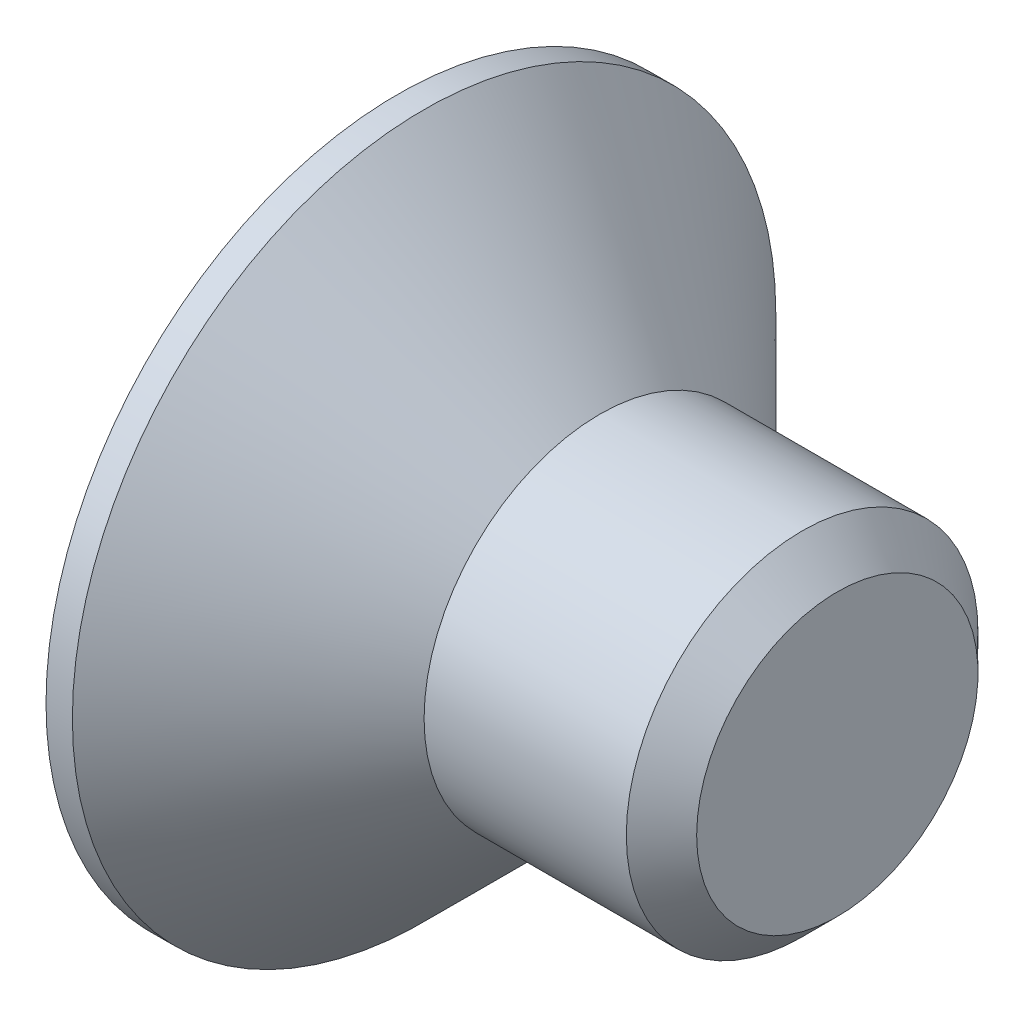
ISO-10303-21;
HEADER;
FILE_DESCRIPTION(('STEP AP214'),'2;1');
FILE_NAME('part.step','',(''),(''),'','','');
FILE_SCHEMA(('AUTOMOTIVE_DESIGN { 1 0 10303 214 1 1 1 1 }'));
ENDSEC;
DATA;
#1=APPLICATION_CONTEXT('core data for automotive mechanical design processes');
#2=APPLICATION_PROTOCOL_DEFINITION('international standard','automotive_design',2000,#1);
#3=PRODUCT_CONTEXT('',#1,'mechanical');
#4=PRODUCT('Part','Part','',(#3));
#5=PRODUCT_RELATED_PRODUCT_CATEGORY('part','',(#4));
#6=PRODUCT_DEFINITION_FORMATION('','',#4);
#7=PRODUCT_DEFINITION_CONTEXT('part definition',#1,'design');
#8=PRODUCT_DEFINITION('design','',#6,#7);
#9=PRODUCT_DEFINITION_SHAPE('','',#8);
#10=(LENGTH_UNIT() NAMED_UNIT(*) SI_UNIT(.MILLI.,.METRE.));
#11=(NAMED_UNIT(*) PLANE_ANGLE_UNIT() SI_UNIT($,.RADIAN.));
#12=(NAMED_UNIT(*) SI_UNIT($,.STERADIAN.) SOLID_ANGLE_UNIT());
#13=UNCERTAINTY_MEASURE_WITH_UNIT(LENGTH_MEASURE(1.E-05),#10,'distance_accuracy_value','');
#14=(GEOMETRIC_REPRESENTATION_CONTEXT(3) GLOBAL_UNCERTAINTY_ASSIGNED_CONTEXT((#13)) GLOBAL_UNIT_ASSIGNED_CONTEXT((#10,
#11,#12)) REPRESENTATION_CONTEXT('',''));
#15=CARTESIAN_POINT('',(0.,0.,0.));
#16=DIRECTION('',(0.,0.,1.));
#17=DIRECTION('',(1.,0.,0.));
#18=AXIS2_PLACEMENT_3D('',#15,#16,#17);
#19=CARTESIAN_POINT('',(-4.68297067855262,15.,1.6));
#20=DIRECTION('',(1.,0.,0.));
#21=DIRECTION('',(0.,1.,0.));
#22=AXIS2_PLACEMENT_3D('',#19,#20,#21);
#23=PLANE('',#22);
#24=CARTESIAN_POINT('',(-4.68297067852973,15.,0.));
#25=DIRECTION('',(-1.,0.,0.));
#26=DIRECTION('',(0.,0.,1.));
#27=AXIS2_PLACEMENT_3D('',#24,#25,#26);
#28=CIRCLE('',#27,1.60000000005311);
#29=CARTESIAN_POINT('',(-4.68297067852973,15.,1.60000000005312));
#30=VERTEX_POINT('',#29);
#31=EDGE_CURVE('E20',#30,#30,#28,.T.);
#32=ORIENTED_EDGE('',*,*,#31,.F.);
#33=EDGE_LOOP('',(#32));
#34=FACE_BOUND('',#33,.T.);
#35=ADVANCED_FACE('F17',(#34),#23,.T.);
#36=CARTESIAN_POINT('',(-5.08297067835883,15.,0.));
#37=DIRECTION('',(-1.,0.,0.));
#38=DIRECTION('',(0.,0.,1.));
#39=AXIS2_PLACEMENT_3D('',#36,#37,#38);
#40=CONICAL_SURFACE('',#39,1.99999999993906,0.785398163468503);
#41=CARTESIAN_POINT('',(-5.08297067855263,15.,0.));
#42=DIRECTION('',(1.,0.,0.));
#43=DIRECTION('',(0.,0.,-1.));
#44=AXIS2_PLACEMENT_3D('',#41,#42,#43);
#45=CIRCLE('',#44,2.);
#46=CARTESIAN_POINT('',(-5.08297067855263,15.,-2.));
#47=VERTEX_POINT('',#46);
#48=EDGE_CURVE('E118',#47,#47,#45,.F.);
#49=ORIENTED_EDGE('',*,*,#48,.F.);
#50=EDGE_LOOP('',(#49));
#51=FACE_BOUND('',#50,.T.);
#52=ORIENTED_EDGE('',*,*,#31,.T.);
#53=EDGE_LOOP('',(#52));
#54=FACE_BOUND('',#53,.T.);
#55=ADVANCED_FACE('F562',(#51,#54),#40,.T.);
#56=CARTESIAN_POINT('',(-7.98297067842668,15.,0.));
#57=DIRECTION('',(-1.,0.,0.));
#58=DIRECTION('',(0.,0.,1.));
#59=AXIS2_PLACEMENT_3D('',#56,#57,#58);
#60=CONICAL_SURFACE('',#59,0.999999999849023,1.04719755100032);
#61=CARTESIAN_POINT('',(-7.40562040925852,15.0000000000716,0.));
#62=VERTEX_POINT('',#61);
#63=VERTEX_LOOP('',#62);
#64=FACE_BOUND('',#63,.T.);
#65=CARTESIAN_POINT('',(-7.98297067852514,15.,0.));
#66=DIRECTION('',(-1.,0.,0.));
#67=DIRECTION('',(0.,0.,1.));
#68=AXIS2_PLACEMENT_3D('',#65,#66,#67);
#69=CIRCLE('',#68,1.00000000001955);
#70=CARTESIAN_POINT('',(-7.98297067853888,15.5000000000049,0.866025403792906));
#71=VERTEX_POINT('',#70);
#72=CARTESIAN_POINT('',(-7.98297067852161,15.9999999999931,0.));
#73=VERTEX_POINT('',#72);
#74=EDGE_CURVE('E110',#71,#73,#69,.T.);
#75=ORIENTED_EDGE('',*,*,#74,.T.);
#76=CARTESIAN_POINT('',(-7.98297067852514,15.,0.));
#77=DIRECTION('',(-1.,0.,0.));
#78=DIRECTION('',(0.,0.,1.));
#79=AXIS2_PLACEMENT_3D('',#76,#77,#78);
#80=CIRCLE('',#79,1.00000000001955);
#81=CARTESIAN_POINT('',(-7.98297067853888,15.5000000000049,-0.866025403792906));
#82=VERTEX_POINT('',#81);
#83=EDGE_CURVE('E114',#73,#82,#80,.T.);
#84=ORIENTED_EDGE('',*,*,#83,.T.);
#85=CARTESIAN_POINT('',(-7.98297067852514,15.,0.));
#86=DIRECTION('',(-1.,0.,0.));
#87=DIRECTION('',(0.,0.,1.));
#88=AXIS2_PLACEMENT_3D('',#85,#86,#87);
#89=CIRCLE('',#88,1.00000000001956);
#90=CARTESIAN_POINT('',(-7.98297067853888,14.4999999999951,-0.866025403792907));
#91=VERTEX_POINT('',#90);
#92=EDGE_CURVE('E135',#82,#91,#89,.T.);
#93=ORIENTED_EDGE('',*,*,#92,.T.);
#94=CARTESIAN_POINT('',(-7.98297067852514,15.,0.));
#95=DIRECTION('',(-1.,0.,0.));
#96=DIRECTION('',(0.,0.,1.));
#97=AXIS2_PLACEMENT_3D('',#94,#95,#96);
#98=CIRCLE('',#97,1.00000000001956);
#99=CARTESIAN_POINT('',(-7.98297067853888,13.9999999999834,0.));
#100=VERTEX_POINT('',#99);
#101=EDGE_CURVE('E136',#91,#100,#98,.T.);
#102=ORIENTED_EDGE('',*,*,#101,.T.);
#103=CARTESIAN_POINT('',(-7.98297067852514,15.,0.));
#104=DIRECTION('',(-1.,0.,0.));
#105=DIRECTION('',(0.,0.,1.));
#106=AXIS2_PLACEMENT_3D('',#103,#104,#105);
#107=CIRCLE('',#106,1.00000000001955);
#108=CARTESIAN_POINT('',(-7.98297067853888,14.4999999999951,0.866025403792907));
#109=VERTEX_POINT('',#108);
#110=EDGE_CURVE('E207',#100,#109,#107,.T.);
#111=ORIENTED_EDGE('',*,*,#110,.T.);
#112=CARTESIAN_POINT('',(-7.98297067852514,15.,0.));
#113=DIRECTION('',(-1.,0.,0.));
#114=DIRECTION('',(0.,0.,1.));
#115=AXIS2_PLACEMENT_3D('',#112,#113,#114);
#116=CIRCLE('',#115,1.00000000001955);
#117=EDGE_CURVE('E107',#109,#71,#116,.T.);
#118=ORIENTED_EDGE('',*,*,#117,.T.);
#119=EDGE_LOOP('',(#75,#84,#93,#102,#111,#118));
#120=FACE_BOUND('',#119,.T.);
#121=ADVANCED_FACE('F112',(#64,#120),#60,.F.);
#122=CARTESIAN_POINT('',(-20.4084985096467,15.,0.));
#123=DIRECTION('',(1.,0.,0.));
#124=DIRECTION('',(0.,0.,-1.));
#125=AXIS2_PLACEMENT_3D('',#122,#123,#124);
#126=CYLINDRICAL_SURFACE('',#125,2.);
#127=CARTESIAN_POINT('',(-7.38297067852045,15.,0.));
#128=DIRECTION('',(-1.,0.,0.));
#129=DIRECTION('',(0.,1.,0.));
#130=AXIS2_PLACEMENT_3D('',#127,#128,#129);
#131=CIRCLE('',#130,1.99999999999591);
#132=CARTESIAN_POINT('',(-7.38297067852045,16.9999999999959,0.));
#133=VERTEX_POINT('',#132);
#134=EDGE_CURVE('E127',#133,#133,#131,.T.);
#135=ORIENTED_EDGE('',*,*,#134,.F.);
#136=EDGE_LOOP('',(#135));
#137=FACE_BOUND('',#136,.T.);
#138=ORIENTED_EDGE('',*,*,#48,.T.);
#139=EDGE_LOOP('',(#138));
#140=FACE_BOUND('',#139,.T.);
#141=ADVANCED_FACE('F541',(#137,#140),#126,.T.);
#142=CARTESIAN_POINT('',(-7.98297067855263,14.,0.577350269189626));
#143=DIRECTION('',(1.,0.,0.));
#144=DIRECTION('',(0.,1.,0.));
#145=AXIS2_PLACEMENT_3D('',#142,#143,#144);
#146=PLANE('',#145);
#147=ORIENTED_EDGE('',*,*,#74,.F.);
#148=DIRECTION('',(0.,-0.866025403784439,0.5));
#149=VECTOR('',#148,1.);
#150=CARTESIAN_POINT('',(-7.98297067855263,15.,1.15470053837925));
#151=LINE('',#150,#149);
#152=CARTESIAN_POINT('',(-7.98297067855263,16.,0.577350269189626));
#153=VERTEX_POINT('',#152);
#154=EDGE_CURVE('E122',#71,#153,#151,.F.);
#155=ORIENTED_EDGE('',*,*,#154,.T.);
#156=DIRECTION('',(0.,0.,1.));
#157=VECTOR('',#156,1.);
#158=CARTESIAN_POINT('',(-7.98297067855262,16.,0.577350269189626));
#159=LINE('',#158,#157);
#160=EDGE_CURVE('E120',#153,#73,#159,.F.);
#161=ORIENTED_EDGE('',*,*,#160,.T.);
#162=EDGE_LOOP('',(#147,#155,#161));
#163=FACE_BOUND('',#162,.T.);
#164=ADVANCED_FACE('F121',(#163),#146,.F.);
#165=CARTESIAN_POINT('',(-7.98297067855263,14.,0.577350269189626));
#166=DIRECTION('',(1.,0.,0.));
#167=DIRECTION('',(0.,1.,0.));
#168=AXIS2_PLACEMENT_3D('',#165,#166,#167);
#169=PLANE('',#168);
#170=ORIENTED_EDGE('',*,*,#117,.F.);
#171=DIRECTION('',(0.,-0.866025403784439,-0.5));
#172=VECTOR('',#171,1.);
#173=CARTESIAN_POINT('',(-7.98297067855263,14.,0.577350269189626));
#174=LINE('',#173,#172);
#175=CARTESIAN_POINT('',(-7.98297067855263,15.,1.15470053837925));
#176=VERTEX_POINT('',#175);
#177=EDGE_CURVE('E173',#109,#176,#174,.F.);
#178=ORIENTED_EDGE('',*,*,#177,.T.);
#179=DIRECTION('',(0.,-0.866025403784439,0.5));
#180=VECTOR('',#179,1.);
#181=CARTESIAN_POINT('',(-7.98297067855263,15.,1.15470053837925));
#182=LINE('',#181,#180);
#183=EDGE_CURVE('E141',#176,#71,#182,.F.);
#184=ORIENTED_EDGE('',*,*,#183,.T.);
#185=EDGE_LOOP('',(#170,#178,#184));
#186=FACE_BOUND('',#185,.T.);
#187=ADVANCED_FACE('F219',(#186),#169,.F.);
#188=CARTESIAN_POINT('',(-7.98297067855263,14.,0.577350269189626));
#189=DIRECTION('',(1.,0.,0.));
#190=DIRECTION('',(0.,1.,0.));
#191=AXIS2_PLACEMENT_3D('',#188,#189,#190);
#192=PLANE('',#191);
#193=ORIENTED_EDGE('',*,*,#110,.F.);
#194=DIRECTION('',(0.,0.,-1.));
#195=VECTOR('',#194,1.);
#196=CARTESIAN_POINT('',(-7.98297067855263,14.,-0.577350269189626));
#197=LINE('',#196,#195);
#198=CARTESIAN_POINT('',(-7.98297067855263,14.,0.577350269189627));
#199=VERTEX_POINT('',#198);
#200=EDGE_CURVE('E159',#100,#199,#197,.F.);
#201=ORIENTED_EDGE('',*,*,#200,.T.);
#202=DIRECTION('',(0.,-0.866025403784439,-0.5));
#203=VECTOR('',#202,1.);
#204=CARTESIAN_POINT('',(-7.98297067855263,14.,0.577350269189626));
#205=LINE('',#204,#203);
#206=EDGE_CURVE('E170',#199,#109,#205,.F.);
#207=ORIENTED_EDGE('',*,*,#206,.T.);
#208=EDGE_LOOP('',(#193,#201,#207));
#209=FACE_BOUND('',#208,.T.);
#210=ADVANCED_FACE('F214',(#209),#192,.F.);
#211=CARTESIAN_POINT('',(-7.98297067855263,14.,0.577350269189626));
#212=DIRECTION('',(1.,0.,0.));
#213=DIRECTION('',(0.,1.,0.));
#214=AXIS2_PLACEMENT_3D('',#211,#212,#213);
#215=PLANE('',#214);
#216=ORIENTED_EDGE('',*,*,#101,.F.);
#217=DIRECTION('',(0.,0.866025403784439,-0.5));
#218=VECTOR('',#217,1.);
#219=CARTESIAN_POINT('',(-7.98297067855262,15.,-1.15470053837925));
#220=LINE('',#219,#218);
#221=CARTESIAN_POINT('',(-7.98297067855262,14.,-0.577350269189627));
#222=VERTEX_POINT('',#221);
#223=EDGE_CURVE('E150',#91,#222,#220,.F.);
#224=ORIENTED_EDGE('',*,*,#223,.T.);
#225=DIRECTION('',(0.,0.,-1.));
#226=VECTOR('',#225,1.);
#227=CARTESIAN_POINT('',(-7.98297067855262,14.,-0.577350269189626));
#228=LINE('',#227,#226);
#229=EDGE_CURVE('E156',#222,#100,#228,.F.);
#230=ORIENTED_EDGE('',*,*,#229,.T.);
#231=EDGE_LOOP('',(#216,#224,#230));
#232=FACE_BOUND('',#231,.T.);
#233=ADVANCED_FACE('F503',(#232),#215,.F.);
#234=CARTESIAN_POINT('',(-7.98297067855263,14.,0.577350269189626));
#235=DIRECTION('',(1.,0.,0.));
#236=DIRECTION('',(0.,1.,0.));
#237=AXIS2_PLACEMENT_3D('',#234,#235,#236);
#238=PLANE('',#237);
#239=ORIENTED_EDGE('',*,*,#83,.F.);
#240=DIRECTION('',(0.,0.,1.));
#241=VECTOR('',#240,1.);
#242=CARTESIAN_POINT('',(-7.98297067855262,16.,0.577350269189626));
#243=LINE('',#242,#241);
#244=CARTESIAN_POINT('',(-7.98297067855262,16.,-0.577350269189626));
#245=VERTEX_POINT('',#244);
#246=EDGE_CURVE('E126',#73,#245,#243,.F.);
#247=ORIENTED_EDGE('',*,*,#246,.T.);
#248=DIRECTION('',(0.,0.866025403784439,0.5));
#249=VECTOR('',#248,1.);
#250=CARTESIAN_POINT('',(-7.98297067855262,16.,-0.577350269189626));
#251=LINE('',#250,#249);
#252=EDGE_CURVE('E133',#245,#82,#251,.F.);
#253=ORIENTED_EDGE('',*,*,#252,.T.);
#254=EDGE_LOOP('',(#239,#247,#253));
#255=FACE_BOUND('',#254,.T.);
#256=ADVANCED_FACE('F130',(#255),#238,.F.);
#257=CARTESIAN_POINT('',(-7.98297067855263,14.,0.577350269189626));
#258=DIRECTION('',(1.,0.,0.));
#259=DIRECTION('',(0.,1.,0.));
#260=AXIS2_PLACEMENT_3D('',#257,#258,#259);
#261=PLANE('',#260);
#262=ORIENTED_EDGE('',*,*,#92,.F.);
#263=DIRECTION('',(0.,0.866025403784439,0.5));
#264=VECTOR('',#263,1.);
#265=CARTESIAN_POINT('',(-7.98297067855262,16.,-0.577350269189626));
#266=LINE('',#265,#264);
#267=CARTESIAN_POINT('',(-7.98297067855262,15.,-1.15470053837925));
#268=VERTEX_POINT('',#267);
#269=EDGE_CURVE('E251',#82,#268,#266,.F.);
#270=ORIENTED_EDGE('',*,*,#269,.T.);
#271=DIRECTION('',(0.,0.866025403784439,-0.5));
#272=VECTOR('',#271,1.);
#273=CARTESIAN_POINT('',(-7.98297067855262,15.,-1.15470053837925));
#274=LINE('',#273,#272);
#275=EDGE_CURVE('E153',#268,#91,#274,.F.);
#276=ORIENTED_EDGE('',*,*,#275,.T.);
#277=EDGE_LOOP('',(#262,#270,#276));
#278=FACE_BOUND('',#277,.T.);
#279=ADVANCED_FACE('F482',(#278),#261,.F.);
#280=CARTESIAN_POINT('',(-9.38297067841631,15.,0.));
#281=DIRECTION('',(-1.,0.,0.));
#282=DIRECTION('',(0.,0.,1.));
#283=AXIS2_PLACEMENT_3D('',#280,#281,#282);
#284=CONICAL_SURFACE('',#283,3.99999999983493,0.785398163383238);
#285=CARTESIAN_POINT('',(-9.38297067855261,15.,0.));
#286=DIRECTION('',(1.,0.,0.));
#287=DIRECTION('',(0.,0.,-1.));
#288=AXIS2_PLACEMENT_3D('',#285,#286,#287);
#289=CIRCLE('',#288,4.);
#290=CARTESIAN_POINT('',(-9.38297067855261,15.,-4.));
#291=VERTEX_POINT('',#290);
#292=EDGE_CURVE('E247',#291,#291,#289,.F.);
#293=ORIENTED_EDGE('',*,*,#292,.F.);
#294=EDGE_LOOP('',(#293));
#295=FACE_BOUND('',#294,.T.);
#296=ORIENTED_EDGE('',*,*,#134,.T.);
#297=EDGE_LOOP('',(#296));
#298=FACE_BOUND('',#297,.T.);
#299=ADVANCED_FACE('F472',(#295,#298),#284,.T.);
#300=CARTESIAN_POINT('',(-7.98297067855262,16.,0.577350269189626));
#301=DIRECTION('',(0.,1.,0.));
#302=DIRECTION('',(0.,0.,1.));
#303=AXIS2_PLACEMENT_3D('',#300,#301,#302);
#304=PLANE('',#303);
#305=DIRECTION('',(0.,0.,1.));
#306=VECTOR('',#305,1.);
#307=CARTESIAN_POINT('',(-9.48297067855263,16.,0.577350269189626));
#308=LINE('',#307,#306);
#309=CARTESIAN_POINT('',(-9.48297067855263,16.,-0.577350269189626));
#310=VERTEX_POINT('',#309);
#311=CARTESIAN_POINT('',(-9.48297067855263,16.,0.577350269189625));
#312=VERTEX_POINT('',#311);
#313=EDGE_CURVE('E241',#310,#312,#308,.T.);
#314=ORIENTED_EDGE('',*,*,#313,.F.);
#315=DIRECTION('',(1.,0.,0.));
#316=VECTOR('',#315,1.);
#317=CARTESIAN_POINT('',(-7.98297067855262,16.,-0.577350269189626));
#318=LINE('',#317,#316);
#319=EDGE_CURVE('E140',#310,#245,#318,.T.);
#320=ORIENTED_EDGE('',*,*,#319,.T.);
#321=ORIENTED_EDGE('',*,*,#246,.F.);
#322=ORIENTED_EDGE('',*,*,#160,.F.);
#323=DIRECTION('',(1.,0.,0.));
#324=VECTOR('',#323,1.);
#325=CARTESIAN_POINT('',(-7.98297067855263,16.,0.577350269189626));
#326=LINE('',#325,#324);
#327=EDGE_CURVE('E174',#153,#312,#326,.F.);
#328=ORIENTED_EDGE('',*,*,#327,.T.);
#329=EDGE_LOOP('',(#314,#320,#321,#322,#328));
#330=FACE_BOUND('',#329,.T.);
#331=ADVANCED_FACE('F138',(#330),#304,.F.);
#332=CARTESIAN_POINT('',(-7.98297067855263,15.,1.15470053837925));
#333=DIRECTION('',(0.,0.5,0.866025403784439));
#334=DIRECTION('',(0.,-0.866025403784439,0.5));
#335=AXIS2_PLACEMENT_3D('',#332,#333,#334);
#336=PLANE('',#335);
#337=DIRECTION('',(0.,-0.866025403784439,0.5));
#338=VECTOR('',#337,1.);
#339=CARTESIAN_POINT('',(-9.48297067855263,16.,0.577350269189625));
#340=LINE('',#339,#338);
#341=CARTESIAN_POINT('',(-9.48297067855263,15.,1.15470053837925));
#342=VERTEX_POINT('',#341);
#343=EDGE_CURVE('E231',#312,#342,#340,.T.);
#344=ORIENTED_EDGE('',*,*,#343,.F.);
#345=ORIENTED_EDGE('',*,*,#327,.F.);
#346=ORIENTED_EDGE('',*,*,#154,.F.);
#347=ORIENTED_EDGE('',*,*,#183,.F.);
#348=DIRECTION('',(1.,0.,0.));
#349=VECTOR('',#348,1.);
#350=CARTESIAN_POINT('',(-7.98297067855263,15.,1.15470053837925));
#351=LINE('',#350,#349);
#352=EDGE_CURVE('E160',#176,#342,#351,.F.);
#353=ORIENTED_EDGE('',*,*,#352,.T.);
#354=EDGE_LOOP('',(#344,#345,#346,#347,#353));
#355=FACE_BOUND('',#354,.T.);
#356=ADVANCED_FACE('F230',(#355),#336,.F.);
#357=CARTESIAN_POINT('',(-7.98297067855263,14.,0.577350269189626));
#358=DIRECTION('',(0.,-0.5,0.866025403784439));
#359=DIRECTION('',(0.,-0.866025403784439,-0.5));
#360=AXIS2_PLACEMENT_3D('',#357,#358,#359);
#361=PLANE('',#360);
#362=DIRECTION('',(0.,-0.866025403784439,-0.5));
#363=VECTOR('',#362,1.);
#364=CARTESIAN_POINT('',(-9.48297067855263,15.,1.15470053837925));
#365=LINE('',#364,#363);
#366=CARTESIAN_POINT('',(-9.48297067855263,14.,0.577350269189626));
#367=VERTEX_POINT('',#366);
#368=EDGE_CURVE('E225',#342,#367,#365,.T.);
#369=ORIENTED_EDGE('',*,*,#368,.F.);
#370=ORIENTED_EDGE('',*,*,#352,.F.);
#371=ORIENTED_EDGE('',*,*,#177,.F.);
#372=ORIENTED_EDGE('',*,*,#206,.F.);
#373=DIRECTION('',(1.,0.,0.));
#374=VECTOR('',#373,1.);
#375=CARTESIAN_POINT('',(-7.98297067855262,14.,0.577350269189627));
#376=LINE('',#375,#374);
#377=EDGE_CURVE('E167',#199,#367,#376,.F.);
#378=ORIENTED_EDGE('',*,*,#377,.T.);
#379=EDGE_LOOP('',(#369,#370,#371,#372,#378));
#380=FACE_BOUND('',#379,.T.);
#381=ADVANCED_FACE('F223',(#380),#361,.F.);
#382=CARTESIAN_POINT('',(-7.98297067855262,14.,-0.577350269189626));
#383=DIRECTION('',(0.,-1.,0.));
#384=DIRECTION('',(0.,0.,-1.));
#385=AXIS2_PLACEMENT_3D('',#382,#383,#384);
#386=PLANE('',#385);
#387=DIRECTION('',(0.,0.,1.));
#388=VECTOR('',#387,1.);
#389=CARTESIAN_POINT('',(-9.48297067855263,14.,-0.577350269189626));
#390=LINE('',#389,#388);
#391=CARTESIAN_POINT('',(-9.48297067855263,14.,-0.577350269189626));
#392=VERTEX_POINT('',#391);
#393=EDGE_CURVE('E292',#367,#392,#390,.F.);
#394=ORIENTED_EDGE('',*,*,#393,.F.);
#395=ORIENTED_EDGE('',*,*,#377,.F.);
#396=ORIENTED_EDGE('',*,*,#200,.F.);
#397=ORIENTED_EDGE('',*,*,#229,.F.);
#398=DIRECTION('',(1.,0.,0.));
#399=VECTOR('',#398,1.);
#400=CARTESIAN_POINT('',(-7.98297067855262,14.,-0.577350269189627));
#401=LINE('',#400,#399);
#402=EDGE_CURVE('E152',#222,#392,#401,.F.);
#403=ORIENTED_EDGE('',*,*,#402,.T.);
#404=EDGE_LOOP('',(#394,#395,#396,#397,#403));
#405=FACE_BOUND('',#404,.T.);
#406=ADVANCED_FACE('F302',(#405),#386,.F.);
#407=CARTESIAN_POINT('',(-7.98297067855262,15.,-1.15470053837925));
#408=DIRECTION('',(0.,-0.5,-0.866025403784439));
#409=DIRECTION('',(0.,0.866025403784439,-0.5));
#410=AXIS2_PLACEMENT_3D('',#407,#408,#409);
#411=PLANE('',#410);
#412=DIRECTION('',(0.,0.866025403784439,-0.5));
#413=VECTOR('',#412,1.);
#414=CARTESIAN_POINT('',(-9.48297067855263,14.,-0.577350269189627));
#415=LINE('',#414,#413);
#416=CARTESIAN_POINT('',(-9.48297067855263,15.,-1.15470053837925));
#417=VERTEX_POINT('',#416);
#418=EDGE_CURVE('E270',#392,#417,#415,.T.);
#419=ORIENTED_EDGE('',*,*,#418,.F.);
#420=ORIENTED_EDGE('',*,*,#402,.F.);
#421=ORIENTED_EDGE('',*,*,#223,.F.);
#422=ORIENTED_EDGE('',*,*,#275,.F.);
#423=DIRECTION('',(1.,0.,0.));
#424=VECTOR('',#423,1.);
#425=CARTESIAN_POINT('',(-7.98297067855262,15.,-1.15470053837925));
#426=LINE('',#425,#424);
#427=EDGE_CURVE('E255',#268,#417,#426,.F.);
#428=ORIENTED_EDGE('',*,*,#427,.T.);
#429=EDGE_LOOP('',(#419,#420,#421,#422,#428));
#430=FACE_BOUND('',#429,.T.);
#431=ADVANCED_FACE('F268',(#430),#411,.F.);
#432=CARTESIAN_POINT('',(-7.98297067855262,16.,-0.577350269189626));
#433=DIRECTION('',(0.,0.5,-0.866025403784439));
#434=DIRECTION('',(0.,0.866025403784439,0.5));
#435=AXIS2_PLACEMENT_3D('',#432,#433,#434);
#436=PLANE('',#435);
#437=DIRECTION('',(0.,0.866025403784439,0.5));
#438=VECTOR('',#437,1.);
#439=CARTESIAN_POINT('',(-9.48297067855263,15.,-1.15470053837925));
#440=LINE('',#439,#438);
#441=EDGE_CURVE('E280',#417,#310,#440,.T.);
#442=ORIENTED_EDGE('',*,*,#441,.F.);
#443=ORIENTED_EDGE('',*,*,#427,.F.);
#444=ORIENTED_EDGE('',*,*,#269,.F.);
#445=ORIENTED_EDGE('',*,*,#252,.F.);
#446=ORIENTED_EDGE('',*,*,#319,.F.);
#447=EDGE_LOOP('',(#442,#443,#444,#445,#446));
#448=FACE_BOUND('',#447,.T.);
#449=ADVANCED_FACE('F281',(#448),#436,.F.);
#450=CARTESIAN_POINT('',(-20.4084985096467,15.,0.));
#451=DIRECTION('',(1.,0.,0.));
#452=DIRECTION('',(0.,0.,-1.));
#453=AXIS2_PLACEMENT_3D('',#450,#451,#452);
#454=CYLINDRICAL_SURFACE('',#453,4.);
#455=CARTESIAN_POINT('',(-9.68297067855262,15.,0.));
#456=DIRECTION('',(1.,0.,0.));
#457=DIRECTION('',(0.,0.,-1.));
#458=AXIS2_PLACEMENT_3D('',#455,#456,#457);
#459=CIRCLE('',#458,4.);
#460=CARTESIAN_POINT('',(-9.68297067855262,15.,-4.));
#461=VERTEX_POINT('',#460);
#462=EDGE_CURVE('E200',#461,#461,#459,.F.);
#463=ORIENTED_EDGE('',*,*,#462,.F.);
#464=EDGE_LOOP('',(#463));
#465=FACE_BOUND('',#464,.T.);
#466=ORIENTED_EDGE('',*,*,#292,.T.);
#467=EDGE_LOOP('',(#466));
#468=FACE_BOUND('',#467,.T.);
#469=ADVANCED_FACE('F324',(#465,#468),#454,.T.);
#470=CARTESIAN_POINT('',(-9.48297067855263,16.,0.577350269189626));
#471=DIRECTION('',(-0.707106781186552,-0.707106781186543,0.));
#472=DIRECTION('',(0.707106781186543,-0.707106781186552,0.));
#473=AXIS2_PLACEMENT_3D('',#470,#471,#472);
#474=PLANE('',#473);
#475=DIRECTION('',(0.654653670707971,-0.654653670707983,-0.377964473009228));
#476=VECTOR('',#475,1.);
#477=CARTESIAN_POINT('',(-9.68297067855262,16.2,0.692820323027551));
#478=LINE('',#477,#476);
#479=CARTESIAN_POINT('',(-9.68297067855262,16.2,0.692820323027551));
#480=VERTEX_POINT('',#479);
#481=EDGE_CURVE('E238',#480,#312,#478,.T.);
#482=ORIENTED_EDGE('',*,*,#481,.F.);
#483=DIRECTION('',(0.,0.,1.));
#484=VECTOR('',#483,1.);
#485=CARTESIAN_POINT('',(-9.68297067855262,16.2,0.));
#486=LINE('',#485,#484);
#487=CARTESIAN_POINT('',(-9.68297067855262,16.2,-0.692820323027553));
#488=VERTEX_POINT('',#487);
#489=EDGE_CURVE('E203',#488,#480,#486,.T.);
#490=ORIENTED_EDGE('',*,*,#489,.F.);
#491=DIRECTION('',(-0.654653670707971,0.654653670707982,-0.377964473009229));
#492=VECTOR('',#491,1.);
#493=CARTESIAN_POINT('',(-9.48297067855263,16.,-0.577350269189626));
#494=LINE('',#493,#492);
#495=EDGE_CURVE('E204',#310,#488,#494,.T.);
#496=ORIENTED_EDGE('',*,*,#495,.F.);
#497=ORIENTED_EDGE('',*,*,#313,.T.);
#498=EDGE_LOOP('',(#482,#490,#496,#497));
#499=FACE_BOUND('',#498,.T.);
#500=ADVANCED_FACE('F322',(#499),#474,.T.);
#501=CARTESIAN_POINT('',(-9.48297067855263,15.,1.15470053837925));
#502=DIRECTION('',(-0.707106781186552,-0.353553390593271,-0.612372435695791));
#503=DIRECTION('',(-0.654653670707972,0.,0.755928946018459));
#504=AXIS2_PLACEMENT_3D('',#501,#502,#503);
#505=PLANE('',#504);
#506=ORIENTED_EDGE('',*,*,#481,.T.);
#507=ORIENTED_EDGE('',*,*,#343,.T.);
#508=DIRECTION('',(-0.654653670707972,0.,0.755928946018459));
#509=VECTOR('',#508,1.);
#510=CARTESIAN_POINT('',(-9.19725639283834,15.,0.824786098842318));
#511=LINE('',#510,#509);
#512=CARTESIAN_POINT('',(-9.68297067855262,15.,1.3856406460551));
#513=VERTEX_POINT('',#512);
#514=EDGE_CURVE('E236',#513,#342,#511,.F.);
#515=ORIENTED_EDGE('',*,*,#514,.F.);
#516=DIRECTION('',(0.,-0.866025403784439,0.5));
#517=VECTOR('',#516,1.);
#518=CARTESIAN_POINT('',(-9.68297067855262,16.2,0.692820323027552));
#519=LINE('',#518,#517);
#520=EDGE_CURVE('E316',#480,#513,#519,.T.);
#521=ORIENTED_EDGE('',*,*,#520,.F.);
#522=EDGE_LOOP('',(#506,#507,#515,#521));
#523=FACE_BOUND('',#522,.T.);
#524=ADVANCED_FACE('F234',(#523),#505,.T.);
#525=CARTESIAN_POINT('',(-9.48297067855263,14.,0.577350269189626));
#526=DIRECTION('',(-0.707106781186553,0.353553390593271,-0.61237243569579));
#527=DIRECTION('',(-0.654653670707972,0.,0.755928946018459));
#528=AXIS2_PLACEMENT_3D('',#525,#526,#527);
#529=PLANE('',#528);
#530=ORIENTED_EDGE('',*,*,#514,.T.);
#531=ORIENTED_EDGE('',*,*,#368,.T.);
#532=DIRECTION('',(0.654653670707973,0.654653670707979,-0.377964473009231));
#533=VECTOR('',#532,1.);
#534=CARTESIAN_POINT('',(-9.68297067855262,13.8,0.692820323027553));
#535=LINE('',#534,#533);
#536=CARTESIAN_POINT('',(-9.68297067855262,13.8,0.692820323027553));
#537=VERTEX_POINT('',#536);
#538=EDGE_CURVE('E295',#537,#367,#535,.T.);
#539=ORIENTED_EDGE('',*,*,#538,.F.);
#540=DIRECTION('',(0.,-0.866025403784438,-0.5));
#541=VECTOR('',#540,1.);
#542=CARTESIAN_POINT('',(-9.68297067855262,15.,1.3856406460551));
#543=LINE('',#542,#541);
#544=EDGE_CURVE('E310',#513,#537,#543,.T.);
#545=ORIENTED_EDGE('',*,*,#544,.F.);
#546=EDGE_LOOP('',(#530,#531,#539,#545));
#547=FACE_BOUND('',#546,.T.);
#548=ADVANCED_FACE('F299',(#547),#529,.T.);
#549=CARTESIAN_POINT('',(-9.48297067855263,14.,-0.577350269189626));
#550=DIRECTION('',(-0.707106781186552,0.707106781186543,0.));
#551=DIRECTION('',(-0.707106781186543,-0.707106781186552,0.));
#552=AXIS2_PLACEMENT_3D('',#549,#550,#551);
#553=PLANE('',#552);
#554=ORIENTED_EDGE('',*,*,#538,.T.);
#555=ORIENTED_EDGE('',*,*,#393,.T.);
#556=DIRECTION('',(0.654653670707974,0.654653670707979,0.37796447300923));
#557=VECTOR('',#556,1.);
#558=CARTESIAN_POINT('',(-9.68297067855262,13.8,-0.692820323027553));
#559=LINE('',#558,#557);
#560=CARTESIAN_POINT('',(-9.68297067855262,13.8,-0.692820323027552));
#561=VERTEX_POINT('',#560);
#562=EDGE_CURVE('E277',#561,#392,#559,.T.);
#563=ORIENTED_EDGE('',*,*,#562,.F.);
#564=DIRECTION('',(0.,0.,1.));
#565=VECTOR('',#564,1.);
#566=CARTESIAN_POINT('',(-9.68297067855262,13.8,0.));
#567=LINE('',#566,#565);
#568=EDGE_CURVE('E307',#537,#561,#567,.F.);
#569=ORIENTED_EDGE('',*,*,#568,.F.);
#570=EDGE_LOOP('',(#554,#555,#563,#569));
#571=FACE_BOUND('',#570,.T.);
#572=ADVANCED_FACE('F305',(#571),#553,.T.);
#573=CARTESIAN_POINT('',(-9.48297067855263,15.,-1.15470053837925));
#574=DIRECTION('',(-0.707106781186552,0.353553390593272,0.612372435695791));
#575=DIRECTION('',(0.654653670707972,0.,0.755928946018458));
#576=AXIS2_PLACEMENT_3D('',#573,#574,#575);
#577=PLANE('',#576);
#578=ORIENTED_EDGE('',*,*,#562,.T.);
#579=ORIENTED_EDGE('',*,*,#418,.T.);
#580=DIRECTION('',(0.654653670707972,0.,0.755928946018459));
#581=VECTOR('',#580,1.);
#582=CARTESIAN_POINT('',(-9.19725639283834,15.,-0.824786098842319));
#583=LINE('',#582,#581);
#584=CARTESIAN_POINT('',(-9.68297067855262,15.,-1.3856406460551));
#585=VERTEX_POINT('',#584);
#586=EDGE_CURVE('E35',#585,#417,#583,.T.);
#587=ORIENTED_EDGE('',*,*,#586,.F.);
#588=DIRECTION('',(0.,0.866025403784438,-0.500000000000001));
#589=VECTOR('',#588,1.);
#590=CARTESIAN_POINT('',(-9.68297067855262,13.8,-0.692820323027552));
#591=LINE('',#590,#589);
#592=EDGE_CURVE('E26',#561,#585,#591,.T.);
#593=ORIENTED_EDGE('',*,*,#592,.F.);
#594=EDGE_LOOP('',(#578,#579,#587,#593));
#595=FACE_BOUND('',#594,.T.);
#596=ADVANCED_FACE('F276',(#595),#577,.T.);
#597=CARTESIAN_POINT('',(-9.48297067855263,16.,-0.577350269189626));
#598=DIRECTION('',(-0.707106781186553,-0.353553390593271,0.61237243569579));
#599=DIRECTION('',(0.654653670707972,0.,0.755928946018459));
#600=AXIS2_PLACEMENT_3D('',#597,#598,#599);
#601=PLANE('',#600);
#602=ORIENTED_EDGE('',*,*,#495,.T.);
#603=DIRECTION('',(0.,0.866025403784439,0.499999999999999));
#604=VECTOR('',#603,1.);
#605=CARTESIAN_POINT('',(-9.68297067855262,15.,-1.3856406460551));
#606=LINE('',#605,#604);
#607=EDGE_CURVE('E11',#585,#488,#606,.T.);
#608=ORIENTED_EDGE('',*,*,#607,.F.);
#609=ORIENTED_EDGE('',*,*,#586,.T.);
#610=ORIENTED_EDGE('',*,*,#441,.T.);
#611=EDGE_LOOP('',(#602,#608,#609,#610));
#612=FACE_BOUND('',#611,.T.);
#613=ADVANCED_FACE('F286',(#612),#601,.T.);
#614=CARTESIAN_POINT('',(-9.68297067855262,15.,0.));
#615=DIRECTION('',(-1.,0.,0.));
#616=DIRECTION('',(0.,0.,1.));
#617=AXIS2_PLACEMENT_3D('',#614,#615,#616);
#618=PLANE('',#617);
#619=ORIENTED_EDGE('',*,*,#592,.T.);
#620=ORIENTED_EDGE('',*,*,#607,.T.);
#621=ORIENTED_EDGE('',*,*,#489,.T.);
#622=ORIENTED_EDGE('',*,*,#520,.T.);
#623=ORIENTED_EDGE('',*,*,#544,.T.);
#624=ORIENTED_EDGE('',*,*,#568,.T.);
#625=EDGE_LOOP('',(#619,#620,#621,#622,#623,#624));
#626=FACE_BOUND('',#625,.T.);
#627=ORIENTED_EDGE('',*,*,#462,.T.);
#628=EDGE_LOOP('',(#627));
#629=FACE_BOUND('',#628,.T.);
#630=ADVANCED_FACE('F313',(#626,#629),#618,.T.);
#631=CLOSED_SHELL('',(#35,#55,#121,#141,#164,#187,#210,#233,#256,#279,#299,#331,#356,#381,#406,
#431,#449,#469,#500,#524,#548,#572,#596,#613,#630));
#632=MANIFOLD_SOLID_BREP('B1',#631);
#633=ADVANCED_BREP_SHAPE_REPRESENTATION('',(#18,#632),#14);
#634=SHAPE_DEFINITION_REPRESENTATION(#9,#633);
ENDSEC;
END-ISO-10303-21;
